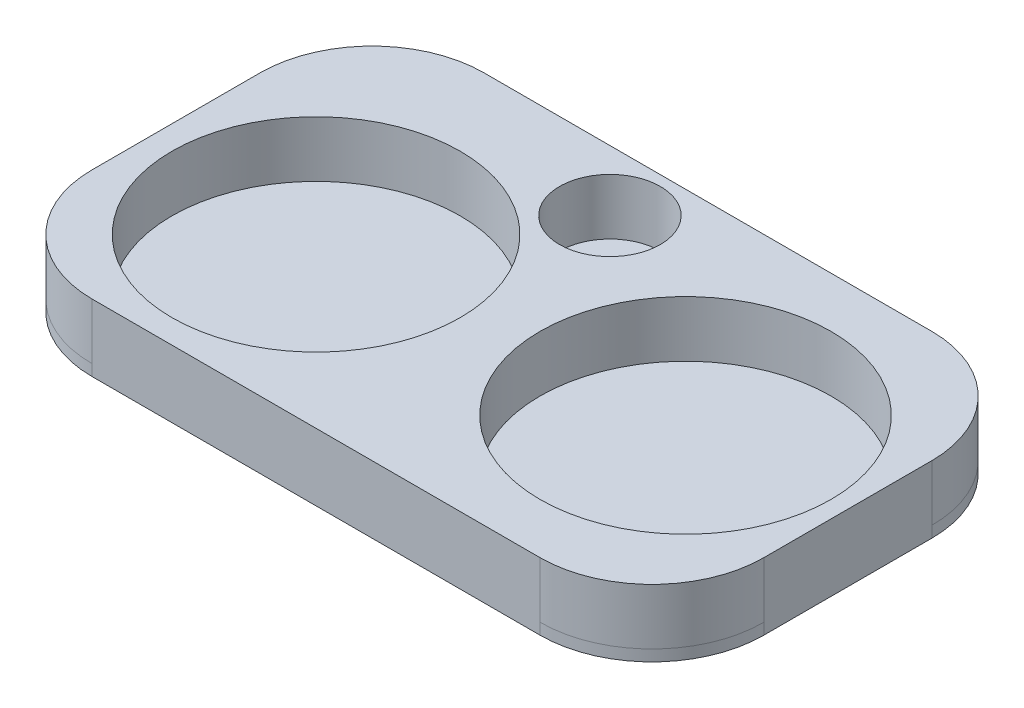
ISO-10303-21;
HEADER;
FILE_DESCRIPTION(('STEP AP214'),'2;1');
FILE_NAME('part.step','',(''),(''),'','','');
FILE_SCHEMA(('AUTOMOTIVE_DESIGN { 1 0 10303 214 1 1 1 1 }'));
ENDSEC;
DATA;
#1=APPLICATION_CONTEXT('core data for automotive mechanical design processes');
#2=APPLICATION_PROTOCOL_DEFINITION('international standard','automotive_design',2000,#1);
#3=PRODUCT_CONTEXT('',#1,'mechanical');
#4=PRODUCT('Part','Part','',(#3));
#5=PRODUCT_RELATED_PRODUCT_CATEGORY('part','',(#4));
#6=PRODUCT_DEFINITION_FORMATION('','',#4);
#7=PRODUCT_DEFINITION_CONTEXT('part definition',#1,'design');
#8=PRODUCT_DEFINITION('design','',#6,#7);
#9=PRODUCT_DEFINITION_SHAPE('','',#8);
#10=(LENGTH_UNIT() NAMED_UNIT(*) SI_UNIT(.MILLI.,.METRE.));
#11=(NAMED_UNIT(*) PLANE_ANGLE_UNIT() SI_UNIT($,.RADIAN.));
#12=(NAMED_UNIT(*) SI_UNIT($,.STERADIAN.) SOLID_ANGLE_UNIT());
#13=UNCERTAINTY_MEASURE_WITH_UNIT(LENGTH_MEASURE(1.E-05),#10,'distance_accuracy_value','');
#14=(GEOMETRIC_REPRESENTATION_CONTEXT(3) GLOBAL_UNCERTAINTY_ASSIGNED_CONTEXT((#13)) GLOBAL_UNIT_ASSIGNED_CONTEXT((#10,
#11,#12)) REPRESENTATION_CONTEXT('',''));
#15=CARTESIAN_POINT('',(0.,0.,0.));
#16=DIRECTION('',(0.,0.,1.));
#17=DIRECTION('',(1.,0.,0.));
#18=AXIS2_PLACEMENT_3D('',#15,#16,#17);
#19=CARTESIAN_POINT('',(0.,12.,0.));
#20=DIRECTION('',(0.,1.,0.));
#21=DIRECTION('',(0.,0.,1.));
#22=AXIS2_PLACEMENT_3D('',#19,#20,#21);
#23=PLANE('',#22);
#24=CARTESIAN_POINT('',(60.4561725520277,12.,29.4931531935341));
#25=DIRECTION('',(0.,1.,0.));
#26=DIRECTION('',(0.,0.,1.));
#27=AXIS2_PLACEMENT_3D('',#24,#25,#26);
#28=CIRCLE('',#27,26.);
#29=CARTESIAN_POINT('',(60.4561725520277,12.,55.4931531935341));
#30=VERTEX_POINT('',#29);
#31=EDGE_CURVE('E216',#30,#30,#28,.T.);
#32=ORIENTED_EDGE('',*,*,#31,.F.);
#33=EDGE_LOOP('',(#32));
#34=FACE_BOUND('',#33,.T.);
#35=DIRECTION('',(0.,0.,-1.));
#36=VECTOR('',#35,1.);
#37=CARTESIAN_POINT('',(89.4561725520277,12.,-5.50684680646592));
#38=LINE('',#37,#36);
#39=CARTESIAN_POINT('',(89.4561725520277,12.,44.4931531935341));
#40=VERTEX_POINT('',#39);
#41=CARTESIAN_POINT('',(89.4561725520277,12.,14.4931531935341));
#42=VERTEX_POINT('',#41);
#43=EDGE_CURVE('E207',#40,#42,#38,.T.);
#44=ORIENTED_EDGE('',*,*,#43,.T.);
#45=CARTESIAN_POINT('',(69.4561725520277,12.,14.4931531935341));
#46=DIRECTION('',(0.,1.,0.));
#47=DIRECTION('',(0.,0.,1.));
#48=AXIS2_PLACEMENT_3D('',#45,#46,#47);
#49=CIRCLE('',#48,20.);
#50=CARTESIAN_POINT('',(69.4561725520277,12.,-5.50684680646592));
#51=VERTEX_POINT('',#50);
#52=EDGE_CURVE('E175',#42,#51,#49,.T.);
#53=ORIENTED_EDGE('',*,*,#52,.T.);
#54=DIRECTION('',(-1.,0.,0.));
#55=VECTOR('',#54,1.);
#56=CARTESIAN_POINT('',(-30.5438274479723,12.,-5.50684680646592));
#57=LINE('',#56,#55);
#58=CARTESIAN_POINT('',(-10.5438274479723,12.,-5.50684680646592));
#59=VERTEX_POINT('',#58);
#60=EDGE_CURVE('E192',#51,#59,#57,.T.);
#61=ORIENTED_EDGE('',*,*,#60,.T.);
#62=CARTESIAN_POINT('',(-10.5438274479723,12.,14.4931531935341));
#63=DIRECTION('',(0.,1.,0.));
#64=DIRECTION('',(0.,0.,1.));
#65=AXIS2_PLACEMENT_3D('',#62,#63,#64);
#66=CIRCLE('',#65,20.);
#67=CARTESIAN_POINT('',(-30.5438274479723,12.,14.4931531935341));
#68=VERTEX_POINT('',#67);
#69=EDGE_CURVE('E179',#59,#68,#66,.T.);
#70=ORIENTED_EDGE('',*,*,#69,.T.);
#71=DIRECTION('',(0.,0.,1.));
#72=VECTOR('',#71,1.);
#73=CARTESIAN_POINT('',(-30.5438274479723,12.,-5.50684680646592));
#74=LINE('',#73,#72);
#75=CARTESIAN_POINT('',(-30.5438274479723,12.,44.4931531935341));
#76=VERTEX_POINT('',#75);
#77=EDGE_CURVE('E139',#68,#76,#74,.T.);
#78=ORIENTED_EDGE('',*,*,#77,.T.);
#79=CARTESIAN_POINT('',(-10.5438274479723,12.,44.4931531935341));
#80=DIRECTION('',(0.,1.,0.));
#81=DIRECTION('',(0.,0.,1.));
#82=AXIS2_PLACEMENT_3D('',#79,#80,#81);
#83=CIRCLE('',#82,20.);
#84=CARTESIAN_POINT('',(-10.5438274479723,12.,64.4931531935341));
#85=VERTEX_POINT('',#84);
#86=EDGE_CURVE('E181',#76,#85,#83,.T.);
#87=ORIENTED_EDGE('',*,*,#86,.T.);
#88=DIRECTION('',(1.,0.,0.));
#89=VECTOR('',#88,1.);
#90=CARTESIAN_POINT('',(-30.5438274479723,12.,64.4931531935341));
#91=LINE('',#90,#89);
#92=CARTESIAN_POINT('',(69.4561725520277,12.,64.4931531935341));
#93=VERTEX_POINT('',#92);
#94=EDGE_CURVE('E210',#85,#93,#91,.T.);
#95=ORIENTED_EDGE('',*,*,#94,.T.);
#96=CARTESIAN_POINT('',(69.4561725520277,12.,44.4931531935341));
#97=DIRECTION('',(0.,1.,0.));
#98=DIRECTION('',(0.,0.,1.));
#99=AXIS2_PLACEMENT_3D('',#96,#97,#98);
#100=CIRCLE('',#99,20.);
#101=EDGE_CURVE('E177',#93,#40,#100,.T.);
#102=ORIENTED_EDGE('',*,*,#101,.T.);
#103=EDGE_LOOP('',(#44,#53,#61,#70,#78,#87,#95,#102));
#104=FACE_BOUND('',#103,.T.);
#105=CARTESIAN_POINT('',(-0.543827447972284,12.,34.4931531935341));
#106=DIRECTION('',(0.,1.,0.));
#107=DIRECTION('',(0.,0.,1.));
#108=AXIS2_PLACEMENT_3D('',#105,#106,#107);
#109=CIRCLE('',#108,25.75);
#110=CARTESIAN_POINT('',(-0.543827447972284,12.,60.2431531935341));
#111=VERTEX_POINT('',#110);
#112=EDGE_CURVE('E204',#111,#111,#109,.T.);
#113=ORIENTED_EDGE('',*,*,#112,.F.);
#114=EDGE_LOOP('',(#113));
#115=FACE_BOUND('',#114,.T.);
#116=CARTESIAN_POINT('',(22.7751956877904,12.,5.32106069101756));
#117=DIRECTION('',(0.,1.,0.));
#118=DIRECTION('',(0.,0.,1.));
#119=AXIS2_PLACEMENT_3D('',#116,#117,#118);
#120=CIRCLE('',#119,9.00000000000001);
#121=CARTESIAN_POINT('',(22.7751956877904,12.,14.3210606910176));
#122=VERTEX_POINT('',#121);
#123=EDGE_CURVE('E219',#122,#122,#120,.T.);
#124=ORIENTED_EDGE('',*,*,#123,.F.);
#125=EDGE_LOOP('',(#124));
#126=FACE_BOUND('',#125,.T.);
#127=ADVANCED_FACE('F36',(#34,#104,#115,#126),#23,.T.);
#128=CARTESIAN_POINT('',(0.,0.,0.));
#129=DIRECTION('',(0.,1.,0.));
#130=DIRECTION('',(0.,0.,1.));
#131=AXIS2_PLACEMENT_3D('',#128,#129,#130);
#132=PLANE('',#131);
#133=DIRECTION('',(-1.,0.,0.));
#134=VECTOR('',#133,1.);
#135=CARTESIAN_POINT('',(-30.5438274479723,0.,-5.50684680646592));
#136=LINE('',#135,#134);
#137=CARTESIAN_POINT('',(69.4561725520277,0.,-5.50684680646592));
#138=VERTEX_POINT('',#137);
#139=CARTESIAN_POINT('',(-10.5438274479723,0.,-5.50684680646592));
#140=VERTEX_POINT('',#139);
#141=EDGE_CURVE('E193',#138,#140,#136,.T.);
#142=ORIENTED_EDGE('',*,*,#141,.F.);
#143=CARTESIAN_POINT('',(69.4561725520277,0.,14.4931531935341));
#144=DIRECTION('',(0.,1.,0.));
#145=DIRECTION('',(0.,0.,1.));
#146=AXIS2_PLACEMENT_3D('',#143,#144,#145);
#147=CIRCLE('',#146,20.);
#148=CARTESIAN_POINT('',(89.4561725520277,0.,14.4931531935341));
#149=VERTEX_POINT('',#148);
#150=EDGE_CURVE('E154',#138,#149,#147,.F.);
#151=ORIENTED_EDGE('',*,*,#150,.T.);
#152=DIRECTION('',(0.,0.,-1.));
#153=VECTOR('',#152,1.);
#154=CARTESIAN_POINT('',(89.4561725520277,0.,-5.50684680646592));
#155=LINE('',#154,#153);
#156=CARTESIAN_POINT('',(89.4561725520277,0.,44.4931531935341));
#157=VERTEX_POINT('',#156);
#158=EDGE_CURVE('E196',#157,#149,#155,.T.);
#159=ORIENTED_EDGE('',*,*,#158,.F.);
#160=CARTESIAN_POINT('',(69.4561725520277,0.,44.4931531935341));
#161=DIRECTION('',(0.,1.,0.));
#162=DIRECTION('',(0.,0.,1.));
#163=AXIS2_PLACEMENT_3D('',#160,#161,#162);
#164=CIRCLE('',#163,20.);
#165=CARTESIAN_POINT('',(69.4561725520277,0.,64.4931531935341));
#166=VERTEX_POINT('',#165);
#167=EDGE_CURVE('E156',#157,#166,#164,.F.);
#168=ORIENTED_EDGE('',*,*,#167,.T.);
#169=DIRECTION('',(1.,0.,0.));
#170=VECTOR('',#169,1.);
#171=CARTESIAN_POINT('',(-30.5438274479723,0.,64.4931531935341));
#172=LINE('',#171,#170);
#173=CARTESIAN_POINT('',(-10.5438274479723,0.,64.4931531935341));
#174=VERTEX_POINT('',#173);
#175=EDGE_CURVE('E199',#174,#166,#172,.T.);
#176=ORIENTED_EDGE('',*,*,#175,.F.);
#177=CARTESIAN_POINT('',(-10.5438274479723,0.,44.4931531935341));
#178=DIRECTION('',(0.,1.,0.));
#179=DIRECTION('',(0.,0.,1.));
#180=AXIS2_PLACEMENT_3D('',#177,#178,#179);
#181=CIRCLE('',#180,20.);
#182=CARTESIAN_POINT('',(-30.5438274479723,0.,44.4931531935341));
#183=VERTEX_POINT('',#182);
#184=EDGE_CURVE('E51',#174,#183,#181,.F.);
#185=ORIENTED_EDGE('',*,*,#184,.T.);
#186=DIRECTION('',(0.,0.,1.));
#187=VECTOR('',#186,1.);
#188=CARTESIAN_POINT('',(-30.5438274479723,0.,-5.50684680646592));
#189=LINE('',#188,#187);
#190=CARTESIAN_POINT('',(-30.5438274479723,0.,14.4931531935341));
#191=VERTEX_POINT('',#190);
#192=EDGE_CURVE('E202',#191,#183,#189,.T.);
#193=ORIENTED_EDGE('',*,*,#192,.F.);
#194=CARTESIAN_POINT('',(-10.5438274479723,0.,14.4931531935341));
#195=DIRECTION('',(0.,1.,0.));
#196=DIRECTION('',(0.,0.,1.));
#197=AXIS2_PLACEMENT_3D('',#194,#195,#196);
#198=CIRCLE('',#197,20.);
#199=EDGE_CURVE('E59',#191,#140,#198,.F.);
#200=ORIENTED_EDGE('',*,*,#199,.T.);
#201=EDGE_LOOP('',(#142,#151,#159,#168,#176,#185,#193,#200));
#202=FACE_BOUND('',#201,.T.);
#203=ADVANCED_FACE('F261',(#202),#132,.F.);
#204=CARTESIAN_POINT('',(-30.5438274479723,12.,-5.50684680646592));
#205=DIRECTION('',(1.,0.,0.));
#206=DIRECTION('',(0.,0.,-1.));
#207=AXIS2_PLACEMENT_3D('',#204,#205,#206);
#208=PLANE('',#207);
#209=ORIENTED_EDGE('',*,*,#192,.T.);
#210=DIRECTION('',(0.,-1.,0.));
#211=VECTOR('',#210,1.);
#212=CARTESIAN_POINT('',(-30.5438274479723,12.,44.4931531935341));
#213=LINE('',#212,#211);
#214=CARTESIAN_POINT('',(-30.5438274479723,2.,44.4931531935341));
#215=VERTEX_POINT('',#214);
#216=EDGE_CURVE('E11',#183,#215,#213,.F.);
#217=ORIENTED_EDGE('',*,*,#216,.T.);
#218=DIRECTION('',(0.,-1.,0.));
#219=VECTOR('',#218,1.);
#220=CARTESIAN_POINT('',(-30.5438274479723,12.,44.4931531935341));
#221=LINE('',#220,#219);
#222=EDGE_CURVE('E141',#215,#76,#221,.F.);
#223=ORIENTED_EDGE('',*,*,#222,.T.);
#224=ORIENTED_EDGE('',*,*,#77,.F.);
#225=DIRECTION('',(0.,-1.,0.));
#226=VECTOR('',#225,1.);
#227=CARTESIAN_POINT('',(-30.5438274479723,12.,14.4931531935341));
#228=LINE('',#227,#226);
#229=CARTESIAN_POINT('',(-30.5438274479723,2.,14.4931531935341));
#230=VERTEX_POINT('',#229);
#231=EDGE_CURVE('E131',#68,#230,#228,.T.);
#232=ORIENTED_EDGE('',*,*,#231,.T.);
#233=DIRECTION('',(0.,-1.,0.));
#234=VECTOR('',#233,1.);
#235=CARTESIAN_POINT('',(-30.5438274479723,12.,14.4931531935341));
#236=LINE('',#235,#234);
#237=EDGE_CURVE('E44',#230,#191,#236,.T.);
#238=ORIENTED_EDGE('',*,*,#237,.T.);
#239=EDGE_LOOP('',(#209,#217,#223,#224,#232,#238));
#240=FACE_BOUND('',#239,.T.);
#241=ADVANCED_FACE('F137',(#240),#208,.F.);
#242=CARTESIAN_POINT('',(-30.5438274479723,12.,64.4931531935341));
#243=DIRECTION('',(0.,0.,-1.));
#244=DIRECTION('',(-1.,0.,0.));
#245=AXIS2_PLACEMENT_3D('',#242,#243,#244);
#246=PLANE('',#245);
#247=ORIENTED_EDGE('',*,*,#175,.T.);
#248=DIRECTION('',(0.,-1.,0.));
#249=VECTOR('',#248,1.);
#250=CARTESIAN_POINT('',(69.4561725520277,12.,64.4931531935341));
#251=LINE('',#250,#249);
#252=CARTESIAN_POINT('',(69.4561725520277,2.,64.4931531935341));
#253=VERTEX_POINT('',#252);
#254=EDGE_CURVE('E143',#166,#253,#251,.F.);
#255=ORIENTED_EDGE('',*,*,#254,.T.);
#256=DIRECTION('',(0.,-1.,0.));
#257=VECTOR('',#256,1.);
#258=CARTESIAN_POINT('',(69.4561725520277,12.,64.4931531935341));
#259=LINE('',#258,#257);
#260=EDGE_CURVE('E170',#253,#93,#259,.F.);
#261=ORIENTED_EDGE('',*,*,#260,.T.);
#262=ORIENTED_EDGE('',*,*,#94,.F.);
#263=DIRECTION('',(0.,-1.,0.));
#264=VECTOR('',#263,1.);
#265=CARTESIAN_POINT('',(-10.5438274479723,12.,64.4931531935341));
#266=LINE('',#265,#264);
#267=CARTESIAN_POINT('',(-10.5438274479723,2.,64.4931531935341));
#268=VERTEX_POINT('',#267);
#269=EDGE_CURVE('E172',#85,#268,#266,.T.);
#270=ORIENTED_EDGE('',*,*,#269,.T.);
#271=DIRECTION('',(0.,-1.,0.));
#272=VECTOR('',#271,1.);
#273=CARTESIAN_POINT('',(-10.5438274479723,12.,64.4931531935341));
#274=LINE('',#273,#272);
#275=EDGE_CURVE('E144',#268,#174,#274,.T.);
#276=ORIENTED_EDGE('',*,*,#275,.T.);
#277=EDGE_LOOP('',(#247,#255,#261,#262,#270,#276));
#278=FACE_BOUND('',#277,.T.);
#279=ADVANCED_FACE('F270',(#278),#246,.F.);
#280=CARTESIAN_POINT('',(89.4561725520277,12.,-5.50684680646592));
#281=DIRECTION('',(-1.,0.,0.));
#282=DIRECTION('',(0.,0.,1.));
#283=AXIS2_PLACEMENT_3D('',#280,#281,#282);
#284=PLANE('',#283);
#285=ORIENTED_EDGE('',*,*,#158,.T.);
#286=DIRECTION('',(0.,-1.,0.));
#287=VECTOR('',#286,1.);
#288=CARTESIAN_POINT('',(89.4561725520277,12.,14.4931531935341));
#289=LINE('',#288,#287);
#290=CARTESIAN_POINT('',(89.4561725520277,2.,14.4931531935341));
#291=VERTEX_POINT('',#290);
#292=EDGE_CURVE('E149',#149,#291,#289,.F.);
#293=ORIENTED_EDGE('',*,*,#292,.T.);
#294=DIRECTION('',(0.,-1.,0.));
#295=VECTOR('',#294,1.);
#296=CARTESIAN_POINT('',(89.4561725520277,12.,14.4931531935341));
#297=LINE('',#296,#295);
#298=EDGE_CURVE('E183',#291,#42,#297,.F.);
#299=ORIENTED_EDGE('',*,*,#298,.T.);
#300=ORIENTED_EDGE('',*,*,#43,.F.);
#301=DIRECTION('',(0.,-1.,0.));
#302=VECTOR('',#301,1.);
#303=CARTESIAN_POINT('',(89.4561725520277,12.,44.4931531935341));
#304=LINE('',#303,#302);
#305=CARTESIAN_POINT('',(89.4561725520277,2.,44.4931531935341));
#306=VERTEX_POINT('',#305);
#307=EDGE_CURVE('E185',#40,#306,#304,.T.);
#308=ORIENTED_EDGE('',*,*,#307,.T.);
#309=DIRECTION('',(0.,-1.,0.));
#310=VECTOR('',#309,1.);
#311=CARTESIAN_POINT('',(89.4561725520277,12.,44.4931531935341));
#312=LINE('',#311,#310);
#313=EDGE_CURVE('E151',#306,#157,#312,.T.);
#314=ORIENTED_EDGE('',*,*,#313,.T.);
#315=EDGE_LOOP('',(#285,#293,#299,#300,#308,#314));
#316=FACE_BOUND('',#315,.T.);
#317=ADVANCED_FACE('F244',(#316),#284,.F.);
#318=CARTESIAN_POINT('',(-30.5438274479723,12.,-5.50684680646592));
#319=DIRECTION('',(0.,0.,1.));
#320=DIRECTION('',(1.,0.,0.));
#321=AXIS2_PLACEMENT_3D('',#318,#319,#320);
#322=PLANE('',#321);
#323=DIRECTION('',(0.,-1.,0.));
#324=VECTOR('',#323,1.);
#325=CARTESIAN_POINT('',(69.4561725520277,12.,-5.50684680646592));
#326=LINE('',#325,#324);
#327=CARTESIAN_POINT('',(69.4561725520277,2.,-5.50684680646592));
#328=VERTEX_POINT('',#327);
#329=EDGE_CURVE('E188',#51,#328,#326,.T.);
#330=ORIENTED_EDGE('',*,*,#329,.T.);
#331=DIRECTION('',(0.,-1.,0.));
#332=VECTOR('',#331,1.);
#333=CARTESIAN_POINT('',(69.4561725520277,12.,-5.50684680646592));
#334=LINE('',#333,#332);
#335=EDGE_CURVE('E160',#328,#138,#334,.T.);
#336=ORIENTED_EDGE('',*,*,#335,.T.);
#337=ORIENTED_EDGE('',*,*,#141,.T.);
#338=DIRECTION('',(0.,-1.,0.));
#339=VECTOR('',#338,1.);
#340=CARTESIAN_POINT('',(-10.5438274479723,12.,-5.50684680646592));
#341=LINE('',#340,#339);
#342=CARTESIAN_POINT('',(-10.5438274479723,2.,-5.50684680646592));
#343=VERTEX_POINT('',#342);
#344=EDGE_CURVE('E163',#140,#343,#341,.F.);
#345=ORIENTED_EDGE('',*,*,#344,.T.);
#346=DIRECTION('',(0.,-1.,0.));
#347=VECTOR('',#346,1.);
#348=CARTESIAN_POINT('',(-10.5438274479723,12.,-5.50684680646592));
#349=LINE('',#348,#347);
#350=EDGE_CURVE('E132',#343,#59,#349,.F.);
#351=ORIENTED_EDGE('',*,*,#350,.T.);
#352=ORIENTED_EDGE('',*,*,#60,.F.);
#353=EDGE_LOOP('',(#330,#336,#337,#345,#351,#352));
#354=FACE_BOUND('',#353,.T.);
#355=ADVANCED_FACE('F256',(#354),#322,.F.);
#356=CARTESIAN_POINT('',(-0.543827447972284,12.,34.4931531935341));
#357=DIRECTION('',(0.,-1.,0.));
#358=DIRECTION('',(0.,0.,-1.));
#359=AXIS2_PLACEMENT_3D('',#356,#357,#358);
#360=CYLINDRICAL_SURFACE('',#359,25.75);
#361=CARTESIAN_POINT('',(-0.543827447972284,2.,34.4931531935341));
#362=DIRECTION('',(0.,1.,0.));
#363=DIRECTION('',(0.,0.,1.));
#364=AXIS2_PLACEMENT_3D('',#361,#362,#363);
#365=CIRCLE('',#364,25.75);
#366=CARTESIAN_POINT('',(-0.543827447972284,2.,60.2431531935341));
#367=VERTEX_POINT('',#366);
#368=EDGE_CURVE('E165',#367,#367,#365,.T.);
#369=ORIENTED_EDGE('',*,*,#368,.F.);
#370=EDGE_LOOP('',(#369));
#371=FACE_BOUND('',#370,.T.);
#372=ORIENTED_EDGE('',*,*,#112,.T.);
#373=EDGE_LOOP('',(#372));
#374=FACE_BOUND('',#373,.T.);
#375=ADVANCED_FACE('F289',(#371,#374),#360,.F.);
#376=CARTESIAN_POINT('',(60.4561725520277,12.,29.4931531935341));
#377=DIRECTION('',(0.,-1.,0.));
#378=DIRECTION('',(0.,0.,-1.));
#379=AXIS2_PLACEMENT_3D('',#376,#377,#378);
#380=CYLINDRICAL_SURFACE('',#379,26.);
#381=CARTESIAN_POINT('',(60.4561725520277,2.,29.4931531935341));
#382=DIRECTION('',(0.,1.,0.));
#383=DIRECTION('',(0.,0.,1.));
#384=AXIS2_PLACEMENT_3D('',#381,#382,#383);
#385=CIRCLE('',#384,26.);
#386=CARTESIAN_POINT('',(60.4561725520277,2.,55.4931531935341));
#387=VERTEX_POINT('',#386);
#388=EDGE_CURVE('E225',#387,#387,#385,.T.);
#389=ORIENTED_EDGE('',*,*,#388,.F.);
#390=EDGE_LOOP('',(#389));
#391=FACE_BOUND('',#390,.T.);
#392=ORIENTED_EDGE('',*,*,#31,.T.);
#393=EDGE_LOOP('',(#392));
#394=FACE_BOUND('',#393,.T.);
#395=ADVANCED_FACE('F331',(#391,#394),#380,.F.);
#396=CARTESIAN_POINT('',(22.7751956877904,12.,5.32106069101756));
#397=DIRECTION('',(0.,-1.,0.));
#398=DIRECTION('',(0.,0.,-1.));
#399=AXIS2_PLACEMENT_3D('',#396,#397,#398);
#400=CYLINDRICAL_SURFACE('',#399,9.00000000000001);
#401=CARTESIAN_POINT('',(22.7751956877904,2.,5.32106069101756));
#402=DIRECTION('',(0.,1.,0.));
#403=DIRECTION('',(0.,0.,1.));
#404=AXIS2_PLACEMENT_3D('',#401,#402,#403);
#405=CIRCLE('',#404,9.00000000000001);
#406=CARTESIAN_POINT('',(22.7751956877904,2.,14.3210606910176));
#407=VERTEX_POINT('',#406);
#408=EDGE_CURVE('E167',#407,#407,#405,.T.);
#409=ORIENTED_EDGE('',*,*,#408,.F.);
#410=EDGE_LOOP('',(#409));
#411=FACE_BOUND('',#410,.T.);
#412=ORIENTED_EDGE('',*,*,#123,.T.);
#413=EDGE_LOOP('',(#412));
#414=FACE_BOUND('',#413,.T.);
#415=ADVANCED_FACE('F302',(#411,#414),#400,.F.);
#416=CARTESIAN_POINT('',(69.4561725520277,12.,14.4931531935341));
#417=DIRECTION('',(0.,-1.,0.));
#418=DIRECTION('',(0.,0.,-1.));
#419=AXIS2_PLACEMENT_3D('',#416,#417,#418);
#420=CYLINDRICAL_SURFACE('',#419,20.);
#421=CARTESIAN_POINT('',(69.4561725520277,2.,14.4931531935341));
#422=DIRECTION('',(0.,1.,0.));
#423=DIRECTION('',(0.,0.,1.));
#424=AXIS2_PLACEMENT_3D('',#421,#422,#423);
#425=CIRCLE('',#424,20.);
#426=EDGE_CURVE('E222',#328,#291,#425,.F.);
#427=ORIENTED_EDGE('',*,*,#426,.F.);
#428=ORIENTED_EDGE('',*,*,#329,.F.);
#429=ORIENTED_EDGE('',*,*,#52,.F.);
#430=ORIENTED_EDGE('',*,*,#298,.F.);
#431=EDGE_LOOP('',(#427,#428,#429,#430));
#432=FACE_BOUND('',#431,.T.);
#433=ADVANCED_FACE('F253',(#432),#420,.T.);
#434=CARTESIAN_POINT('',(69.4561725520277,12.,44.4931531935341));
#435=DIRECTION('',(0.,-1.,0.));
#436=DIRECTION('',(0.,0.,-1.));
#437=AXIS2_PLACEMENT_3D('',#434,#435,#436);
#438=CYLINDRICAL_SURFACE('',#437,20.);
#439=CARTESIAN_POINT('',(69.4561725520277,2.,44.4931531935341));
#440=DIRECTION('',(0.,1.,0.));
#441=DIRECTION('',(0.,0.,1.));
#442=AXIS2_PLACEMENT_3D('',#439,#440,#441);
#443=CIRCLE('',#442,20.);
#444=EDGE_CURVE('E133',#306,#253,#443,.F.);
#445=ORIENTED_EDGE('',*,*,#444,.F.);
#446=ORIENTED_EDGE('',*,*,#307,.F.);
#447=ORIENTED_EDGE('',*,*,#101,.F.);
#448=ORIENTED_EDGE('',*,*,#260,.F.);
#449=EDGE_LOOP('',(#445,#446,#447,#448));
#450=FACE_BOUND('',#449,.T.);
#451=ADVANCED_FACE('F240',(#450),#438,.T.);
#452=CARTESIAN_POINT('',(-10.5438274479723,12.,14.4931531935341));
#453=DIRECTION('',(0.,-1.,0.));
#454=DIRECTION('',(0.,0.,-1.));
#455=AXIS2_PLACEMENT_3D('',#452,#453,#454);
#456=CYLINDRICAL_SURFACE('',#455,20.);
#457=CARTESIAN_POINT('',(-10.5438274479723,2.,14.4931531935341));
#458=DIRECTION('',(0.,1.,0.));
#459=DIRECTION('',(0.,0.,1.));
#460=AXIS2_PLACEMENT_3D('',#457,#458,#459);
#461=CIRCLE('',#460,20.);
#462=EDGE_CURVE('E127',#230,#343,#461,.F.);
#463=ORIENTED_EDGE('',*,*,#462,.F.);
#464=ORIENTED_EDGE('',*,*,#231,.F.);
#465=ORIENTED_EDGE('',*,*,#69,.F.);
#466=ORIENTED_EDGE('',*,*,#350,.F.);
#467=EDGE_LOOP('',(#463,#464,#465,#466));
#468=FACE_BOUND('',#467,.T.);
#469=ADVANCED_FACE('F129',(#468),#456,.T.);
#470=CARTESIAN_POINT('',(-10.5438274479723,12.,44.4931531935341));
#471=DIRECTION('',(0.,-1.,0.));
#472=DIRECTION('',(0.,0.,-1.));
#473=AXIS2_PLACEMENT_3D('',#470,#471,#472);
#474=CYLINDRICAL_SURFACE('',#473,20.);
#475=CARTESIAN_POINT('',(-10.5438274479723,2.,44.4931531935341));
#476=DIRECTION('',(0.,1.,0.));
#477=DIRECTION('',(0.,0.,1.));
#478=AXIS2_PLACEMENT_3D('',#475,#476,#477);
#479=CIRCLE('',#478,20.);
#480=EDGE_CURVE('E140',#268,#215,#479,.F.);
#481=ORIENTED_EDGE('',*,*,#480,.F.);
#482=ORIENTED_EDGE('',*,*,#269,.F.);
#483=ORIENTED_EDGE('',*,*,#86,.F.);
#484=ORIENTED_EDGE('',*,*,#222,.F.);
#485=EDGE_LOOP('',(#481,#482,#483,#484));
#486=FACE_BOUND('',#485,.T.);
#487=ADVANCED_FACE('F267',(#486),#474,.T.);
#488=CARTESIAN_POINT('',(0.,2.,0.));
#489=DIRECTION('',(0.,1.,0.));
#490=DIRECTION('',(0.,0.,1.));
#491=AXIS2_PLACEMENT_3D('',#488,#489,#490);
#492=PLANE('',#491);
#493=ORIENTED_EDGE('',*,*,#408,.T.);
#494=EDGE_LOOP('',(#493));
#495=FACE_BOUND('',#494,.T.);
#496=ADVANCED_FACE('F309',(#495),#492,.T.);
#497=ORIENTED_EDGE('',*,*,#388,.T.);
#498=EDGE_LOOP('',(#497));
#499=FACE_BOUND('',#498,.T.);
#500=ADVANCED_FACE('F315',(#499),#492,.T.);
#501=ORIENTED_EDGE('',*,*,#368,.T.);
#502=EDGE_LOOP('',(#501));
#503=FACE_BOUND('',#502,.T.);
#504=ADVANCED_FACE('F311',(#503),#492,.T.);
#505=CARTESIAN_POINT('',(69.4561725520277,12.,14.4931531935341));
#506=DIRECTION('',(0.,-1.,0.));
#507=DIRECTION('',(0.,0.,-1.));
#508=AXIS2_PLACEMENT_3D('',#505,#506,#507);
#509=CYLINDRICAL_SURFACE('',#508,20.);
#510=ORIENTED_EDGE('',*,*,#426,.T.);
#511=ORIENTED_EDGE('',*,*,#292,.F.);
#512=ORIENTED_EDGE('',*,*,#150,.F.);
#513=ORIENTED_EDGE('',*,*,#335,.F.);
#514=EDGE_LOOP('',(#510,#511,#512,#513));
#515=FACE_BOUND('',#514,.T.);
#516=ADVANCED_FACE('F259',(#515),#509,.T.);
#517=CARTESIAN_POINT('',(69.4561725520277,12.,44.4931531935341));
#518=DIRECTION('',(0.,-1.,0.));
#519=DIRECTION('',(0.,0.,-1.));
#520=AXIS2_PLACEMENT_3D('',#517,#518,#519);
#521=CYLINDRICAL_SURFACE('',#520,20.);
#522=ORIENTED_EDGE('',*,*,#444,.T.);
#523=ORIENTED_EDGE('',*,*,#254,.F.);
#524=ORIENTED_EDGE('',*,*,#167,.F.);
#525=ORIENTED_EDGE('',*,*,#313,.F.);
#526=EDGE_LOOP('',(#522,#523,#524,#525));
#527=FACE_BOUND('',#526,.T.);
#528=ADVANCED_FACE('F236',(#527),#521,.T.);
#529=CARTESIAN_POINT('',(-10.5438274479723,12.,44.4931531935341));
#530=DIRECTION('',(0.,-1.,0.));
#531=DIRECTION('',(0.,0.,-1.));
#532=AXIS2_PLACEMENT_3D('',#529,#530,#531);
#533=CYLINDRICAL_SURFACE('',#532,20.);
#534=ORIENTED_EDGE('',*,*,#480,.T.);
#535=ORIENTED_EDGE('',*,*,#216,.F.);
#536=ORIENTED_EDGE('',*,*,#184,.F.);
#537=ORIENTED_EDGE('',*,*,#275,.F.);
#538=EDGE_LOOP('',(#534,#535,#536,#537));
#539=FACE_BOUND('',#538,.T.);
#540=ADVANCED_FACE('F272',(#539),#533,.T.);
#541=CARTESIAN_POINT('',(-10.5438274479723,12.,14.4931531935341));
#542=DIRECTION('',(0.,-1.,0.));
#543=DIRECTION('',(0.,0.,-1.));
#544=AXIS2_PLACEMENT_3D('',#541,#542,#543);
#545=CYLINDRICAL_SURFACE('',#544,20.);
#546=ORIENTED_EDGE('',*,*,#462,.T.);
#547=ORIENTED_EDGE('',*,*,#344,.F.);
#548=ORIENTED_EDGE('',*,*,#199,.F.);
#549=ORIENTED_EDGE('',*,*,#237,.F.);
#550=EDGE_LOOP('',(#546,#547,#548,#549));
#551=FACE_BOUND('',#550,.T.);
#552=ADVANCED_FACE('F38',(#551),#545,.T.);
#553=CLOSED_SHELL('',(#127,#203,#241,#279,#317,#355,#375,#395,#415,#433,#451,#469,#487,#496,
#500,#504,#516,#528,#540,#552));
#554=MANIFOLD_SOLID_BREP('B2',#553);
#555=ADVANCED_BREP_SHAPE_REPRESENTATION('',(#18,#554),#14);
#556=SHAPE_DEFINITION_REPRESENTATION(#9,#555);
ENDSEC;
END-ISO-10303-21;
